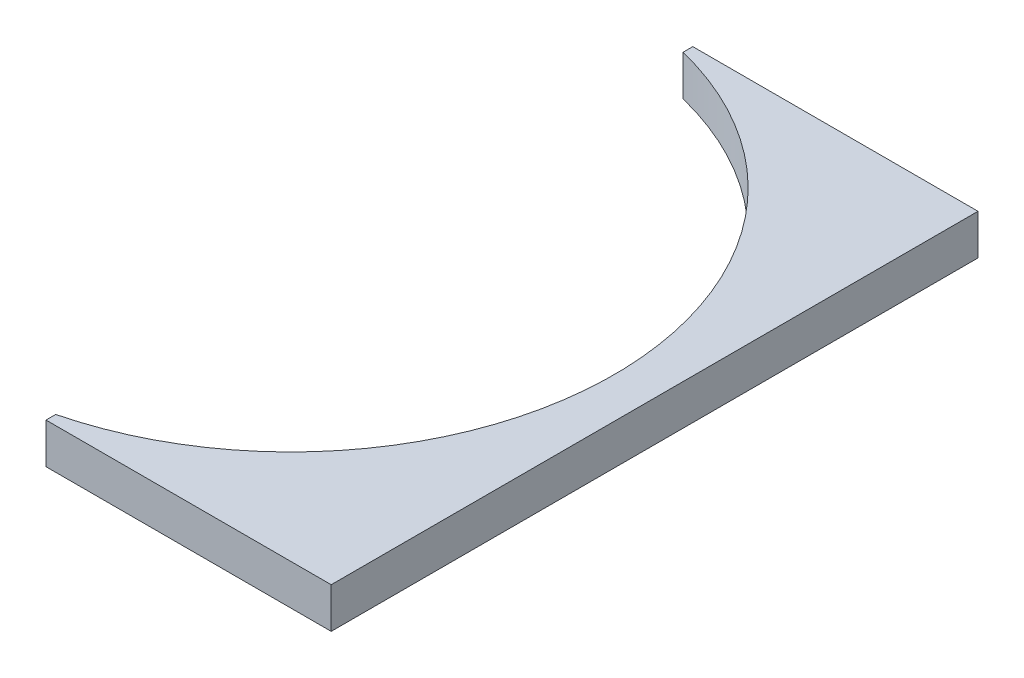
ISO-10303-21;
HEADER;
FILE_DESCRIPTION(('STEP AP214'),'2;1');
FILE_NAME('part.step','',(''),(''),'','','');
FILE_SCHEMA(('AUTOMOTIVE_DESIGN { 1 0 10303 214 1 1 1 1 }'));
ENDSEC;
DATA;
#1=APPLICATION_CONTEXT('core data for automotive mechanical design processes');
#2=APPLICATION_PROTOCOL_DEFINITION('international standard','automotive_design',2000,#1);
#3=PRODUCT_CONTEXT('',#1,'mechanical');
#4=PRODUCT('Part','Part','',(#3));
#5=PRODUCT_RELATED_PRODUCT_CATEGORY('part','',(#4));
#6=PRODUCT_DEFINITION_FORMATION('','',#4);
#7=PRODUCT_DEFINITION_CONTEXT('part definition',#1,'design');
#8=PRODUCT_DEFINITION('design','',#6,#7);
#9=PRODUCT_DEFINITION_SHAPE('','',#8);
#10=(LENGTH_UNIT() NAMED_UNIT(*) SI_UNIT(.MILLI.,.METRE.));
#11=(NAMED_UNIT(*) PLANE_ANGLE_UNIT() SI_UNIT($,.RADIAN.));
#12=(NAMED_UNIT(*) SI_UNIT($,.STERADIAN.) SOLID_ANGLE_UNIT());
#13=UNCERTAINTY_MEASURE_WITH_UNIT(LENGTH_MEASURE(1.E-05),#10,'distance_accuracy_value','');
#14=(GEOMETRIC_REPRESENTATION_CONTEXT(3) GLOBAL_UNCERTAINTY_ASSIGNED_CONTEXT((#13)) GLOBAL_UNIT_ASSIGNED_CONTEXT((#10,
#11,#12)) REPRESENTATION_CONTEXT('',''));
#15=CARTESIAN_POINT('',(0.,0.,0.));
#16=DIRECTION('',(0.,0.,1.));
#17=DIRECTION('',(1.,0.,0.));
#18=AXIS2_PLACEMENT_3D('',#15,#16,#17);
#19=CARTESIAN_POINT('',(0.,3.175,0.));
#20=DIRECTION('',(0.,-1.,0.));
#21=DIRECTION('',(0.,0.,-1.));
#22=AXIS2_PLACEMENT_3D('',#19,#20,#21);
#23=CYLINDRICAL_SURFACE('',#22,25.4);
#24=CARTESIAN_POINT('',(0.,0.,0.));
#25=DIRECTION('',(0.,1.,0.));
#26=DIRECTION('',(0.,0.,1.));
#27=AXIS2_PLACEMENT_3D('',#24,#25,#26);
#28=CIRCLE('',#27,25.4);
#29=CARTESIAN_POINT('',(6.17486485682075,0.,24.638));
#30=VERTEX_POINT('',#29);
#31=CARTESIAN_POINT('',(6.17486485682075,0.,-24.638));
#32=VERTEX_POINT('',#31);
#33=EDGE_CURVE('E125',#30,#32,#28,.T.);
#34=ORIENTED_EDGE('',*,*,#33,.F.);
#35=DIRECTION('',(0.,-1.,0.));
#36=VECTOR('',#35,1.);
#37=CARTESIAN_POINT('',(6.17486485682075,3.175,24.638));
#38=LINE('',#37,#36);
#39=CARTESIAN_POINT('',(6.17486485682075,3.175,24.638));
#40=VERTEX_POINT('',#39);
#41=EDGE_CURVE('E11',#40,#30,#38,.T.);
#42=ORIENTED_EDGE('',*,*,#41,.F.);
#43=CARTESIAN_POINT('',(0.,3.175,0.));
#44=DIRECTION('',(0.,1.,0.));
#45=DIRECTION('',(0.,0.,1.));
#46=AXIS2_PLACEMENT_3D('',#43,#44,#45);
#47=CIRCLE('',#46,25.4);
#48=CARTESIAN_POINT('',(6.17486485682075,3.175,-24.638));
#49=VERTEX_POINT('',#48);
#50=EDGE_CURVE('E145',#40,#49,#47,.T.);
#51=ORIENTED_EDGE('',*,*,#50,.T.);
#52=DIRECTION('',(0.,-1.,0.));
#53=VECTOR('',#52,1.);
#54=CARTESIAN_POINT('',(6.17486485682075,3.175,-24.638));
#55=LINE('',#54,#53);
#56=EDGE_CURVE('E84',#49,#32,#55,.T.);
#57=ORIENTED_EDGE('',*,*,#56,.T.);
#58=EDGE_LOOP('',(#34,#42,#51,#57));
#59=FACE_BOUND('',#58,.T.);
#60=ADVANCED_FACE('F39',(#59),#23,.F.);
#61=CARTESIAN_POINT('',(6.17486485682075,3.175,0.));
#62=DIRECTION('',(-1.,0.,0.));
#63=DIRECTION('',(0.,0.,1.));
#64=AXIS2_PLACEMENT_3D('',#61,#62,#63);
#65=PLANE('',#64);
#66=DIRECTION('',(0.,0.,-1.));
#67=VECTOR('',#66,1.);
#68=CARTESIAN_POINT('',(6.17486485682075,0.,0.));
#69=LINE('',#68,#67);
#70=CARTESIAN_POINT('',(6.17486485682075,0.,25.4));
#71=VERTEX_POINT('',#70);
#72=EDGE_CURVE('E129',#71,#30,#69,.T.);
#73=ORIENTED_EDGE('',*,*,#72,.F.);
#74=DIRECTION('',(0.,-1.,0.));
#75=VECTOR('',#74,1.);
#76=CARTESIAN_POINT('',(6.17486485682075,3.175,25.4));
#77=LINE('',#76,#75);
#78=CARTESIAN_POINT('',(6.17486485682075,3.175,25.4));
#79=VERTEX_POINT('',#78);
#80=EDGE_CURVE('E48',#79,#71,#77,.T.);
#81=ORIENTED_EDGE('',*,*,#80,.F.);
#82=DIRECTION('',(0.,0.,-1.));
#83=VECTOR('',#82,1.);
#84=CARTESIAN_POINT('',(6.17486485682075,3.175,0.));
#85=LINE('',#84,#83);
#86=EDGE_CURVE('E163',#79,#40,#85,.T.);
#87=ORIENTED_EDGE('',*,*,#86,.T.);
#88=ORIENTED_EDGE('',*,*,#41,.T.);
#89=EDGE_LOOP('',(#73,#81,#87,#88));
#90=FACE_BOUND('',#89,.T.);
#91=ADVANCED_FACE('F158',(#90),#65,.T.);
#92=CARTESIAN_POINT('',(0.,3.175,25.4));
#93=DIRECTION('',(0.,0.,1.));
#94=DIRECTION('',(1.,0.,0.));
#95=AXIS2_PLACEMENT_3D('',#92,#93,#94);
#96=PLANE('',#95);
#97=DIRECTION('',(-1.,0.,0.));
#98=VECTOR('',#97,1.);
#99=CARTESIAN_POINT('',(0.,0.,25.4));
#100=LINE('',#99,#98);
#101=CARTESIAN_POINT('',(28.575,0.,25.4));
#102=VERTEX_POINT('',#101);
#103=EDGE_CURVE('E133',#102,#71,#100,.T.);
#104=ORIENTED_EDGE('',*,*,#103,.F.);
#105=DIRECTION('',(0.,-1.,0.));
#106=VECTOR('',#105,1.);
#107=CARTESIAN_POINT('',(28.575,3.175,25.4));
#108=LINE('',#107,#106);
#109=CARTESIAN_POINT('',(28.575,3.175,25.4));
#110=VERTEX_POINT('',#109);
#111=EDGE_CURVE('E108',#110,#102,#108,.T.);
#112=ORIENTED_EDGE('',*,*,#111,.F.);
#113=DIRECTION('',(-1.,0.,0.));
#114=VECTOR('',#113,1.);
#115=CARTESIAN_POINT('',(0.,3.175,25.4));
#116=LINE('',#115,#114);
#117=EDGE_CURVE('E115',#110,#79,#116,.T.);
#118=ORIENTED_EDGE('',*,*,#117,.T.);
#119=ORIENTED_EDGE('',*,*,#80,.T.);
#120=EDGE_LOOP('',(#104,#112,#118,#119));
#121=FACE_BOUND('',#120,.T.);
#122=ADVANCED_FACE('F155',(#121),#96,.T.);
#123=CARTESIAN_POINT('',(28.575,3.175,0.));
#124=DIRECTION('',(1.,0.,0.));
#125=DIRECTION('',(0.,0.,-1.));
#126=AXIS2_PLACEMENT_3D('',#123,#124,#125);
#127=PLANE('',#126);
#128=DIRECTION('',(0.,0.,1.));
#129=VECTOR('',#128,1.);
#130=CARTESIAN_POINT('',(28.575,0.,0.));
#131=LINE('',#130,#129);
#132=CARTESIAN_POINT('',(28.575,0.,-25.4));
#133=VERTEX_POINT('',#132);
#134=EDGE_CURVE('E102',#133,#102,#131,.T.);
#135=ORIENTED_EDGE('',*,*,#134,.F.);
#136=DIRECTION('',(0.,-1.,0.));
#137=VECTOR('',#136,1.);
#138=CARTESIAN_POINT('',(28.575,3.175,-25.4));
#139=LINE('',#138,#137);
#140=CARTESIAN_POINT('',(28.575,3.175,-25.4));
#141=VERTEX_POINT('',#140);
#142=EDGE_CURVE('E97',#141,#133,#139,.T.);
#143=ORIENTED_EDGE('',*,*,#142,.F.);
#144=DIRECTION('',(0.,0.,1.));
#145=VECTOR('',#144,1.);
#146=CARTESIAN_POINT('',(28.575,3.175,0.));
#147=LINE('',#146,#145);
#148=EDGE_CURVE('E100',#141,#110,#147,.T.);
#149=ORIENTED_EDGE('',*,*,#148,.T.);
#150=ORIENTED_EDGE('',*,*,#111,.T.);
#151=EDGE_LOOP('',(#135,#143,#149,#150));
#152=FACE_BOUND('',#151,.T.);
#153=ADVANCED_FACE('F99',(#152),#127,.T.);
#154=CARTESIAN_POINT('',(0.,3.175,-25.4));
#155=DIRECTION('',(0.,0.,-1.));
#156=DIRECTION('',(-1.,0.,0.));
#157=AXIS2_PLACEMENT_3D('',#154,#155,#156);
#158=PLANE('',#157);
#159=DIRECTION('',(1.,0.,0.));
#160=VECTOR('',#159,1.);
#161=CARTESIAN_POINT('',(0.,0.,-25.4));
#162=LINE('',#161,#160);
#163=CARTESIAN_POINT('',(6.17486485682075,0.,-25.4));
#164=VERTEX_POINT('',#163);
#165=EDGE_CURVE('E139',#164,#133,#162,.T.);
#166=ORIENTED_EDGE('',*,*,#165,.F.);
#167=DIRECTION('',(0.,-1.,0.));
#168=VECTOR('',#167,1.);
#169=CARTESIAN_POINT('',(6.17486485682075,3.175,-25.4));
#170=LINE('',#169,#168);
#171=CARTESIAN_POINT('',(6.17486485682075,3.175,-25.4));
#172=VERTEX_POINT('',#171);
#173=EDGE_CURVE('E77',#172,#164,#170,.T.);
#174=ORIENTED_EDGE('',*,*,#173,.F.);
#175=DIRECTION('',(1.,0.,0.));
#176=VECTOR('',#175,1.);
#177=CARTESIAN_POINT('',(0.,3.175,-25.4));
#178=LINE('',#177,#176);
#179=EDGE_CURVE('E112',#172,#141,#178,.T.);
#180=ORIENTED_EDGE('',*,*,#179,.T.);
#181=ORIENTED_EDGE('',*,*,#142,.T.);
#182=EDGE_LOOP('',(#166,#174,#180,#181));
#183=FACE_BOUND('',#182,.T.);
#184=ADVANCED_FACE('F118',(#183),#158,.T.);
#185=CARTESIAN_POINT('',(6.17486485682075,3.175,0.));
#186=DIRECTION('',(1.,0.,0.));
#187=DIRECTION('',(0.,0.,-1.));
#188=AXIS2_PLACEMENT_3D('',#185,#186,#187);
#189=PLANE('',#188);
#190=DIRECTION('',(0.,0.,1.));
#191=VECTOR('',#190,1.);
#192=CARTESIAN_POINT('',(6.17486485682075,0.,0.));
#193=LINE('',#192,#191);
#194=EDGE_CURVE('E142',#164,#32,#193,.T.);
#195=ORIENTED_EDGE('',*,*,#194,.T.);
#196=ORIENTED_EDGE('',*,*,#56,.F.);
#197=DIRECTION('',(0.,0.,1.));
#198=VECTOR('',#197,1.);
#199=CARTESIAN_POINT('',(6.17486485682075,3.175,0.));
#200=LINE('',#199,#198);
#201=EDGE_CURVE('E56',#172,#49,#200,.T.);
#202=ORIENTED_EDGE('',*,*,#201,.F.);
#203=ORIENTED_EDGE('',*,*,#173,.T.);
#204=EDGE_LOOP('',(#195,#196,#202,#203));
#205=FACE_BOUND('',#204,.T.);
#206=ADVANCED_FACE('F161',(#205),#189,.F.);
#207=CARTESIAN_POINT('',(0.,3.175,0.));
#208=DIRECTION('',(0.,1.,0.));
#209=DIRECTION('',(0.,0.,1.));
#210=AXIS2_PLACEMENT_3D('',#207,#208,#209);
#211=PLANE('',#210);
#212=ORIENTED_EDGE('',*,*,#50,.F.);
#213=ORIENTED_EDGE('',*,*,#86,.F.);
#214=ORIENTED_EDGE('',*,*,#117,.F.);
#215=ORIENTED_EDGE('',*,*,#148,.F.);
#216=ORIENTED_EDGE('',*,*,#179,.F.);
#217=ORIENTED_EDGE('',*,*,#201,.T.);
#218=EDGE_LOOP('',(#212,#213,#214,#215,#216,#217));
#219=FACE_BOUND('',#218,.T.);
#220=ADVANCED_FACE('F111',(#219),#211,.T.);
#221=CARTESIAN_POINT('',(0.,0.,0.));
#222=DIRECTION('',(0.,1.,0.));
#223=DIRECTION('',(0.,0.,1.));
#224=AXIS2_PLACEMENT_3D('',#221,#222,#223);
#225=PLANE('',#224);
#226=ORIENTED_EDGE('',*,*,#33,.T.);
#227=ORIENTED_EDGE('',*,*,#194,.F.);
#228=ORIENTED_EDGE('',*,*,#165,.T.);
#229=ORIENTED_EDGE('',*,*,#134,.T.);
#230=ORIENTED_EDGE('',*,*,#103,.T.);
#231=ORIENTED_EDGE('',*,*,#72,.T.);
#232=EDGE_LOOP('',(#226,#227,#228,#229,#230,#231));
#233=FACE_BOUND('',#232,.T.);
#234=ADVANCED_FACE('F160',(#233),#225,.F.);
#235=CLOSED_SHELL('',(#60,#91,#122,#153,#184,#206,#220,#234));
#236=MANIFOLD_SOLID_BREP('B2',#235);
#237=ADVANCED_BREP_SHAPE_REPRESENTATION('',(#18,#236),#14);
#238=SHAPE_DEFINITION_REPRESENTATION(#9,#237);
ENDSEC;
END-ISO-10303-21;
